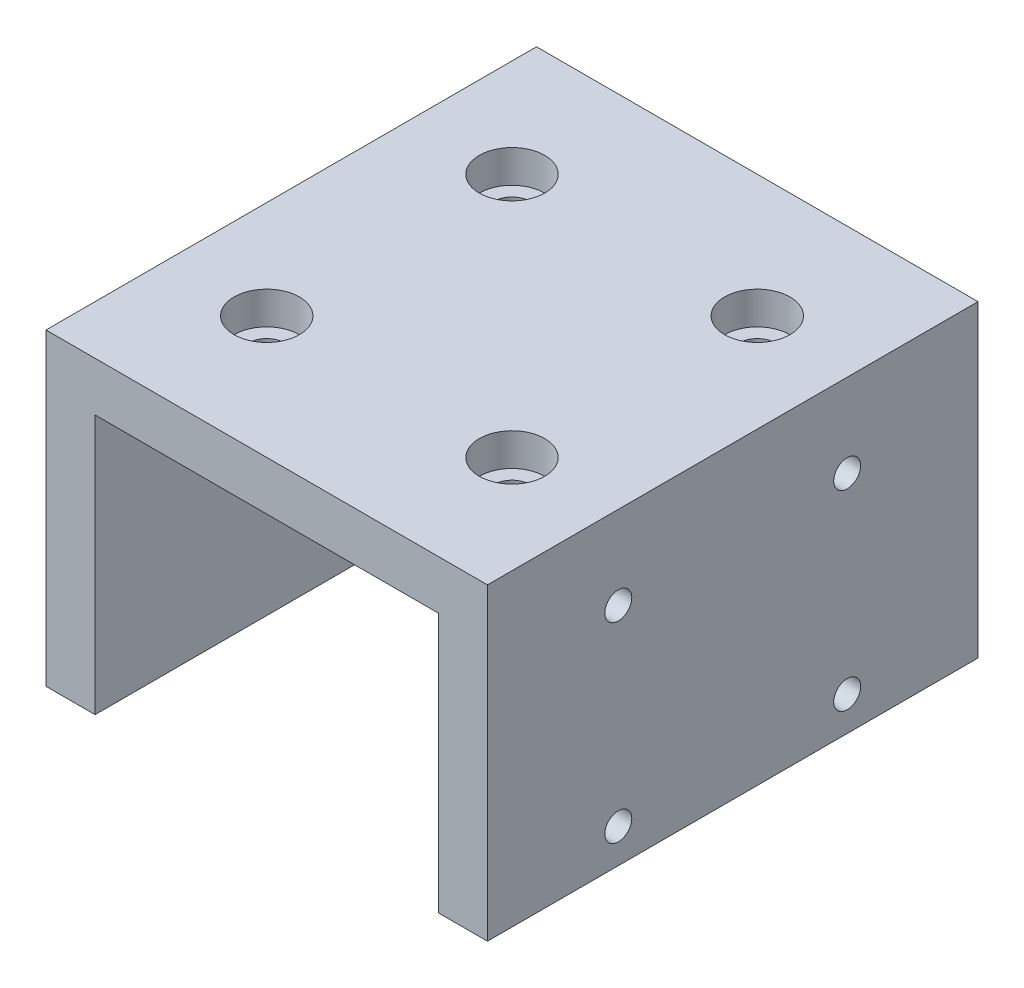
ISO-10303-21;
HEADER;
FILE_DESCRIPTION(('STEP AP214'),'2;1');
FILE_NAME('part.step','',(''),(''),'','','');
FILE_SCHEMA(('AUTOMOTIVE_DESIGN { 1 0 10303 214 1 1 1 1 }'));
ENDSEC;
DATA;
#1=APPLICATION_CONTEXT('core data for automotive mechanical design processes');
#2=APPLICATION_PROTOCOL_DEFINITION('international standard','automotive_design',2000,#1);
#3=PRODUCT_CONTEXT('',#1,'mechanical');
#4=PRODUCT('Part','Part','',(#3));
#5=PRODUCT_RELATED_PRODUCT_CATEGORY('part','',(#4));
#6=PRODUCT_DEFINITION_FORMATION('','',#4);
#7=PRODUCT_DEFINITION_CONTEXT('part definition',#1,'design');
#8=PRODUCT_DEFINITION('design','',#6,#7);
#9=PRODUCT_DEFINITION_SHAPE('','',#8);
#10=(LENGTH_UNIT() NAMED_UNIT(*) SI_UNIT(.MILLI.,.METRE.));
#11=(NAMED_UNIT(*) PLANE_ANGLE_UNIT() SI_UNIT($,.RADIAN.));
#12=(NAMED_UNIT(*) SI_UNIT($,.STERADIAN.) SOLID_ANGLE_UNIT());
#13=UNCERTAINTY_MEASURE_WITH_UNIT(LENGTH_MEASURE(1.E-05),#10,'distance_accuracy_value','');
#14=(GEOMETRIC_REPRESENTATION_CONTEXT(3) GLOBAL_UNCERTAINTY_ASSIGNED_CONTEXT((#13)) GLOBAL_UNIT_ASSIGNED_CONTEXT((#10,
#11,#12)) REPRESENTATION_CONTEXT('',''));
#15=CARTESIAN_POINT('',(0.,0.,0.));
#16=DIRECTION('',(0.,0.,1.));
#17=DIRECTION('',(1.,0.,0.));
#18=AXIS2_PLACEMENT_3D('',#15,#16,#17);
#19=CARTESIAN_POINT('',(27.,37.75,30.));
#20=DIRECTION('',(-1.,0.,0.));
#21=DIRECTION('',(0.,-1.,0.));
#22=AXIS2_PLACEMENT_3D('',#19,#20,#21);
#23=PLANE('',#22);
#24=CARTESIAN_POINT('',(27.,27.575,14.));
#25=DIRECTION('',(1.,0.,0.));
#26=DIRECTION('',(0.,0.,-1.));
#27=AXIS2_PLACEMENT_3D('',#24,#25,#26);
#28=CIRCLE('',#27,1.65);
#29=CARTESIAN_POINT('',(27.,27.575,12.35));
#30=VERTEX_POINT('',#29);
#31=EDGE_CURVE('E302',#30,#30,#28,.T.);
#32=ORIENTED_EDGE('',*,*,#31,.F.);
#33=EDGE_LOOP('',(#32));
#34=FACE_BOUND('',#33,.T.);
#35=DIRECTION('',(0.,1.,0.));
#36=VECTOR('',#35,1.);
#37=CARTESIAN_POINT('',(27.,37.75,-30.));
#38=LINE('',#37,#36);
#39=CARTESIAN_POINT('',(27.,0.,-30.));
#40=VERTEX_POINT('',#39);
#41=CARTESIAN_POINT('',(27.,37.75,-30.));
#42=VERTEX_POINT('',#41);
#43=EDGE_CURVE('E141',#40,#42,#38,.T.);
#44=ORIENTED_EDGE('',*,*,#43,.T.);
#45=DIRECTION('',(0.,0.,-1.));
#46=VECTOR('',#45,1.);
#47=CARTESIAN_POINT('',(27.,37.75,30.));
#48=LINE('',#47,#46);
#49=CARTESIAN_POINT('',(27.,37.75,30.));
#50=VERTEX_POINT('',#49);
#51=EDGE_CURVE('E153',#50,#42,#48,.T.);
#52=ORIENTED_EDGE('',*,*,#51,.F.);
#53=DIRECTION('',(0.,1.,0.));
#54=VECTOR('',#53,1.);
#55=CARTESIAN_POINT('',(27.,37.75,30.));
#56=LINE('',#55,#54);
#57=CARTESIAN_POINT('',(27.,0.,30.));
#58=VERTEX_POINT('',#57);
#59=EDGE_CURVE('E161',#58,#50,#56,.T.);
#60=ORIENTED_EDGE('',*,*,#59,.F.);
#61=DIRECTION('',(0.,0.,-1.));
#62=VECTOR('',#61,1.);
#63=CARTESIAN_POINT('',(27.,0.,30.));
#64=LINE('',#63,#62);
#65=EDGE_CURVE('E55',#58,#40,#64,.T.);
#66=ORIENTED_EDGE('',*,*,#65,.T.);
#67=EDGE_LOOP('',(#44,#52,#60,#66));
#68=FACE_BOUND('',#67,.T.);
#69=CARTESIAN_POINT('',(27.,4.175,-14.));
#70=DIRECTION('',(1.,0.,0.));
#71=DIRECTION('',(0.,0.,-1.));
#72=AXIS2_PLACEMENT_3D('',#69,#70,#71);
#73=CIRCLE('',#72,1.65);
#74=CARTESIAN_POINT('',(27.,4.175,-15.65));
#75=VERTEX_POINT('',#74);
#76=EDGE_CURVE('E308',#75,#75,#73,.T.);
#77=ORIENTED_EDGE('',*,*,#76,.F.);
#78=EDGE_LOOP('',(#77));
#79=FACE_BOUND('',#78,.T.);
#80=CARTESIAN_POINT('',(27.,27.575,-14.));
#81=DIRECTION('',(1.,0.,0.));
#82=DIRECTION('',(0.,0.,-1.));
#83=AXIS2_PLACEMENT_3D('',#80,#81,#82);
#84=CIRCLE('',#83,1.65);
#85=CARTESIAN_POINT('',(27.,27.575,-15.65));
#86=VERTEX_POINT('',#85);
#87=EDGE_CURVE('E314',#86,#86,#84,.T.);
#88=ORIENTED_EDGE('',*,*,#87,.F.);
#89=EDGE_LOOP('',(#88));
#90=FACE_BOUND('',#89,.T.);
#91=CARTESIAN_POINT('',(27.,4.175,14.));
#92=DIRECTION('',(1.,0.,0.));
#93=DIRECTION('',(0.,0.,-1.));
#94=AXIS2_PLACEMENT_3D('',#91,#92,#93);
#95=CIRCLE('',#94,1.65);
#96=CARTESIAN_POINT('',(27.,4.175,12.35));
#97=VERTEX_POINT('',#96);
#98=EDGE_CURVE('E320',#97,#97,#95,.T.);
#99=ORIENTED_EDGE('',*,*,#98,.F.);
#100=EDGE_LOOP('',(#99));
#101=FACE_BOUND('',#100,.T.);
#102=ADVANCED_FACE('F47',(#34,#68,#79,#90,#101),#23,.F.);
#103=CARTESIAN_POINT('',(-27.,37.75,30.));
#104=DIRECTION('',(0.,-1.,0.));
#105=DIRECTION('',(0.,0.,-1.));
#106=AXIS2_PLACEMENT_3D('',#103,#104,#105);
#107=PLANE('',#106);
#108=DIRECTION('',(-1.,0.,0.));
#109=VECTOR('',#108,1.);
#110=CARTESIAN_POINT('',(-27.,37.75,-30.));
#111=LINE('',#110,#109);
#112=CARTESIAN_POINT('',(-27.,37.75,-30.));
#113=VERTEX_POINT('',#112);
#114=EDGE_CURVE('E92',#42,#113,#111,.T.);
#115=ORIENTED_EDGE('',*,*,#114,.T.);
#116=DIRECTION('',(0.,0.,-1.));
#117=VECTOR('',#116,1.);
#118=CARTESIAN_POINT('',(-27.,37.75,30.));
#119=LINE('',#118,#117);
#120=CARTESIAN_POINT('',(-27.,37.75,30.));
#121=VERTEX_POINT('',#120);
#122=EDGE_CURVE('E151',#121,#113,#119,.T.);
#123=ORIENTED_EDGE('',*,*,#122,.F.);
#124=DIRECTION('',(-1.,0.,0.));
#125=VECTOR('',#124,1.);
#126=CARTESIAN_POINT('',(-27.,37.75,30.));
#127=LINE('',#126,#125);
#128=EDGE_CURVE('E71',#50,#121,#127,.T.);
#129=ORIENTED_EDGE('',*,*,#128,.F.);
#130=ORIENTED_EDGE('',*,*,#51,.T.);
#131=EDGE_LOOP('',(#115,#123,#129,#130));
#132=FACE_BOUND('',#131,.T.);
#133=CARTESIAN_POINT('',(15.,37.75,-15.));
#134=DIRECTION('',(0.,1.,0.));
#135=DIRECTION('',(0.,0.,1.));
#136=AXIS2_PLACEMENT_3D('',#133,#134,#135);
#137=CIRCLE('',#136,4.);
#138=CARTESIAN_POINT('',(15.,37.75,-11.));
#139=VERTEX_POINT('',#138);
#140=EDGE_CURVE('E260',#139,#139,#137,.T.);
#141=ORIENTED_EDGE('',*,*,#140,.F.);
#142=EDGE_LOOP('',(#141));
#143=FACE_BOUND('',#142,.T.);
#144=CARTESIAN_POINT('',(-15.,37.75,15.));
#145=DIRECTION('',(0.,1.,0.));
#146=DIRECTION('',(0.,0.,1.));
#147=AXIS2_PLACEMENT_3D('',#144,#145,#146);
#148=CIRCLE('',#147,4.);
#149=CARTESIAN_POINT('',(-15.,37.75,19.));
#150=VERTEX_POINT('',#149);
#151=EDGE_CURVE('E272',#150,#150,#148,.T.);
#152=ORIENTED_EDGE('',*,*,#151,.F.);
#153=EDGE_LOOP('',(#152));
#154=FACE_BOUND('',#153,.T.);
#155=CARTESIAN_POINT('',(-15.,37.75,-15.));
#156=DIRECTION('',(0.,1.,0.));
#157=DIRECTION('',(0.,0.,1.));
#158=AXIS2_PLACEMENT_3D('',#155,#156,#157);
#159=CIRCLE('',#158,4.);
#160=CARTESIAN_POINT('',(-15.,37.75,-11.));
#161=VERTEX_POINT('',#160);
#162=EDGE_CURVE('E284',#161,#161,#159,.T.);
#163=ORIENTED_EDGE('',*,*,#162,.F.);
#164=EDGE_LOOP('',(#163));
#165=FACE_BOUND('',#164,.T.);
#166=CARTESIAN_POINT('',(15.,37.75,15.));
#167=DIRECTION('',(0.,1.,0.));
#168=DIRECTION('',(0.,0.,1.));
#169=AXIS2_PLACEMENT_3D('',#166,#167,#168);
#170=CIRCLE('',#169,4.);
#171=CARTESIAN_POINT('',(15.,37.75,19.));
#172=VERTEX_POINT('',#171);
#173=EDGE_CURVE('E296',#172,#172,#170,.T.);
#174=ORIENTED_EDGE('',*,*,#173,.F.);
#175=EDGE_LOOP('',(#174));
#176=FACE_BOUND('',#175,.T.);
#177=ADVANCED_FACE('F180',(#132,#143,#154,#165,#176),#107,.F.);
#178=CARTESIAN_POINT('',(-27.,37.75,30.));
#179=DIRECTION('',(1.,0.,0.));
#180=DIRECTION('',(0.,1.,0.));
#181=AXIS2_PLACEMENT_3D('',#178,#179,#180);
#182=PLANE('',#181);
#183=CARTESIAN_POINT('',(-27.,25.4,15.));
#184=DIRECTION('',(-1.,0.,0.));
#185=DIRECTION('',(0.,0.,1.));
#186=AXIS2_PLACEMENT_3D('',#183,#184,#185);
#187=CIRCLE('',#186,4.);
#188=CARTESIAN_POINT('',(-27.,25.4,19.));
#189=VERTEX_POINT('',#188);
#190=EDGE_CURVE('E200',#189,#189,#187,.T.);
#191=ORIENTED_EDGE('',*,*,#190,.F.);
#192=EDGE_LOOP('',(#191));
#193=FACE_BOUND('',#192,.T.);
#194=DIRECTION('',(0.,-1.,0.));
#195=VECTOR('',#194,1.);
#196=CARTESIAN_POINT('',(-27.,37.75,-30.));
#197=LINE('',#196,#195);
#198=CARTESIAN_POINT('',(-27.,0.,-30.));
#199=VERTEX_POINT('',#198);
#200=EDGE_CURVE('E145',#113,#199,#197,.T.);
#201=ORIENTED_EDGE('',*,*,#200,.T.);
#202=DIRECTION('',(0.,0.,-1.));
#203=VECTOR('',#202,1.);
#204=CARTESIAN_POINT('',(-27.,0.,30.));
#205=LINE('',#204,#203);
#206=CARTESIAN_POINT('',(-27.,0.,30.));
#207=VERTEX_POINT('',#206);
#208=EDGE_CURVE('E11',#207,#199,#205,.T.);
#209=ORIENTED_EDGE('',*,*,#208,.F.);
#210=DIRECTION('',(0.,-1.,0.));
#211=VECTOR('',#210,1.);
#212=CARTESIAN_POINT('',(-27.,37.75,30.));
#213=LINE('',#212,#211);
#214=EDGE_CURVE('E150',#121,#207,#213,.T.);
#215=ORIENTED_EDGE('',*,*,#214,.F.);
#216=ORIENTED_EDGE('',*,*,#122,.T.);
#217=EDGE_LOOP('',(#201,#209,#215,#216));
#218=FACE_BOUND('',#217,.T.);
#219=CARTESIAN_POINT('',(-27.,25.4,-15.));
#220=DIRECTION('',(-1.,0.,0.));
#221=DIRECTION('',(0.,0.,1.));
#222=AXIS2_PLACEMENT_3D('',#219,#220,#221);
#223=CIRCLE('',#222,4.);
#224=CARTESIAN_POINT('',(-27.,25.4,-11.));
#225=VERTEX_POINT('',#224);
#226=EDGE_CURVE('E212',#225,#225,#223,.T.);
#227=ORIENTED_EDGE('',*,*,#226,.F.);
#228=EDGE_LOOP('',(#227));
#229=FACE_BOUND('',#228,.T.);
#230=CARTESIAN_POINT('',(-27.,7.75000000000002,0.));
#231=DIRECTION('',(-1.,0.,0.));
#232=DIRECTION('',(0.,0.,1.));
#233=AXIS2_PLACEMENT_3D('',#230,#231,#232);
#234=CIRCLE('',#233,4.);
#235=CARTESIAN_POINT('',(-27.,7.75000000000002,4.));
#236=VERTEX_POINT('',#235);
#237=EDGE_CURVE('E224',#236,#236,#234,.T.);
#238=ORIENTED_EDGE('',*,*,#237,.F.);
#239=EDGE_LOOP('',(#238));
#240=FACE_BOUND('',#239,.T.);
#241=CARTESIAN_POINT('',(-27.,24.25,0.));
#242=DIRECTION('',(-1.,0.,0.));
#243=DIRECTION('',(0.,0.,1.));
#244=AXIS2_PLACEMENT_3D('',#241,#242,#243);
#245=CIRCLE('',#244,4.);
#246=CARTESIAN_POINT('',(-27.,24.25,4.));
#247=VERTEX_POINT('',#246);
#248=EDGE_CURVE('E236',#247,#247,#245,.T.);
#249=ORIENTED_EDGE('',*,*,#248,.F.);
#250=EDGE_LOOP('',(#249));
#251=FACE_BOUND('',#250,.T.);
#252=CARTESIAN_POINT('',(-27.,23.25,-24.5));
#253=DIRECTION('',(-1.,0.,0.));
#254=DIRECTION('',(0.,0.,1.));
#255=AXIS2_PLACEMENT_3D('',#252,#253,#254);
#256=CIRCLE('',#255,2.74999999999999);
#257=CARTESIAN_POINT('',(-27.,23.25,-21.75));
#258=VERTEX_POINT('',#257);
#259=EDGE_CURVE('E242',#258,#258,#256,.T.);
#260=ORIENTED_EDGE('',*,*,#259,.F.);
#261=EDGE_LOOP('',(#260));
#262=FACE_BOUND('',#261,.T.);
#263=CARTESIAN_POINT('',(-27.,6.75000000000002,-24.5));
#264=DIRECTION('',(-1.,0.,0.));
#265=DIRECTION('',(0.,0.,1.));
#266=AXIS2_PLACEMENT_3D('',#263,#264,#265);
#267=CIRCLE('',#266,2.74999999999999);
#268=CARTESIAN_POINT('',(-27.,6.75000000000002,-21.75));
#269=VERTEX_POINT('',#268);
#270=EDGE_CURVE('E248',#269,#269,#267,.T.);
#271=ORIENTED_EDGE('',*,*,#270,.F.);
#272=EDGE_LOOP('',(#271));
#273=FACE_BOUND('',#272,.T.);
#274=ADVANCED_FACE('F49',(#193,#218,#229,#240,#251,#262,#273),#182,.F.);
#275=CARTESIAN_POINT('',(-27.,0.,30.));
#276=DIRECTION('',(0.,1.,0.));
#277=DIRECTION('',(0.,0.,1.));
#278=AXIS2_PLACEMENT_3D('',#275,#276,#277);
#279=PLANE('',#278);
#280=DIRECTION('',(1.,0.,0.));
#281=VECTOR('',#280,1.);
#282=CARTESIAN_POINT('',(-27.,0.,-30.));
#283=LINE('',#282,#281);
#284=CARTESIAN_POINT('',(-21.,0.,-30.));
#285=VERTEX_POINT('',#284);
#286=EDGE_CURVE('E133',#199,#285,#283,.T.);
#287=ORIENTED_EDGE('',*,*,#286,.T.);
#288=DIRECTION('',(0.,0.,1.));
#289=VECTOR('',#288,1.);
#290=CARTESIAN_POINT('',(-21.,0.,-30.));
#291=LINE('',#290,#289);
#292=CARTESIAN_POINT('',(-21.,0.,30.));
#293=VERTEX_POINT('',#292);
#294=EDGE_CURVE('E121',#285,#293,#291,.T.);
#295=ORIENTED_EDGE('',*,*,#294,.T.);
#296=DIRECTION('',(1.,0.,0.));
#297=VECTOR('',#296,1.);
#298=CARTESIAN_POINT('',(-27.,0.,30.));
#299=LINE('',#298,#297);
#300=EDGE_CURVE('E99',#207,#293,#299,.T.);
#301=ORIENTED_EDGE('',*,*,#300,.F.);
#302=ORIENTED_EDGE('',*,*,#208,.T.);
#303=EDGE_LOOP('',(#287,#295,#301,#302));
#304=FACE_BOUND('',#303,.T.);
#305=ADVANCED_FACE('F138',(#304),#279,.F.);
#306=CARTESIAN_POINT('',(21.,0.,30.));
#307=VERTEX_POINT('',#306);
#308=EDGE_CURVE('E176',#307,#58,#299,.T.);
#309=ORIENTED_EDGE('',*,*,#308,.F.);
#310=DIRECTION('',(0.,0.,1.));
#311=VECTOR('',#310,1.);
#312=CARTESIAN_POINT('',(21.,0.,-30.));
#313=LINE('',#312,#311);
#314=CARTESIAN_POINT('',(21.,0.,-30.));
#315=VERTEX_POINT('',#314);
#316=EDGE_CURVE('E128',#315,#307,#313,.T.);
#317=ORIENTED_EDGE('',*,*,#316,.F.);
#318=EDGE_CURVE('E142',#315,#40,#283,.T.);
#319=ORIENTED_EDGE('',*,*,#318,.T.);
#320=ORIENTED_EDGE('',*,*,#65,.F.);
#321=EDGE_LOOP('',(#309,#317,#319,#320));
#322=FACE_BOUND('',#321,.T.);
#323=ADVANCED_FACE('F336',(#322),#279,.F.);
#324=CARTESIAN_POINT('',(0.,0.,30.));
#325=DIRECTION('',(0.,0.,1.));
#326=DIRECTION('',(1.,0.,0.));
#327=AXIS2_PLACEMENT_3D('',#324,#325,#326);
#328=PLANE('',#327);
#329=DIRECTION('',(0.,-1.,0.));
#330=VECTOR('',#329,1.);
#331=CARTESIAN_POINT('',(-21.,31.75,30.));
#332=LINE('',#331,#330);
#333=CARTESIAN_POINT('',(-21.,31.75,30.));
#334=VERTEX_POINT('',#333);
#335=EDGE_CURVE('E126',#334,#293,#332,.T.);
#336=ORIENTED_EDGE('',*,*,#335,.F.);
#337=DIRECTION('',(-1.,0.,0.));
#338=VECTOR('',#337,1.);
#339=CARTESIAN_POINT('',(-21.,31.75,30.));
#340=LINE('',#339,#338);
#341=CARTESIAN_POINT('',(21.,31.75,30.));
#342=VERTEX_POINT('',#341);
#343=EDGE_CURVE('E136',#342,#334,#340,.T.);
#344=ORIENTED_EDGE('',*,*,#343,.F.);
#345=DIRECTION('',(0.,1.,0.));
#346=VECTOR('',#345,1.);
#347=CARTESIAN_POINT('',(21.,31.75,30.));
#348=LINE('',#347,#346);
#349=EDGE_CURVE('E185',#307,#342,#348,.T.);
#350=ORIENTED_EDGE('',*,*,#349,.F.);
#351=ORIENTED_EDGE('',*,*,#308,.T.);
#352=ORIENTED_EDGE('',*,*,#59,.T.);
#353=ORIENTED_EDGE('',*,*,#128,.T.);
#354=ORIENTED_EDGE('',*,*,#214,.T.);
#355=ORIENTED_EDGE('',*,*,#300,.T.);
#356=EDGE_LOOP('',(#336,#344,#350,#351,#352,#353,#354,#355));
#357=FACE_BOUND('',#356,.T.);
#358=ADVANCED_FACE('F178',(#357),#328,.T.);
#359=CARTESIAN_POINT('',(0.,0.,-30.));
#360=DIRECTION('',(0.,0.,1.));
#361=DIRECTION('',(1.,0.,0.));
#362=AXIS2_PLACEMENT_3D('',#359,#360,#361);
#363=PLANE('',#362);
#364=DIRECTION('',(-1.,0.,0.));
#365=VECTOR('',#364,1.);
#366=CARTESIAN_POINT('',(-21.,31.75,-30.));
#367=LINE('',#366,#365);
#368=CARTESIAN_POINT('',(21.,31.75,-30.));
#369=VERTEX_POINT('',#368);
#370=CARTESIAN_POINT('',(-21.,31.75,-30.));
#371=VERTEX_POINT('',#370);
#372=EDGE_CURVE('E62',#369,#371,#367,.T.);
#373=ORIENTED_EDGE('',*,*,#372,.T.);
#374=DIRECTION('',(0.,-1.,0.));
#375=VECTOR('',#374,1.);
#376=CARTESIAN_POINT('',(-21.,31.75,-30.));
#377=LINE('',#376,#375);
#378=EDGE_CURVE('E124',#371,#285,#377,.T.);
#379=ORIENTED_EDGE('',*,*,#378,.T.);
#380=ORIENTED_EDGE('',*,*,#286,.F.);
#381=ORIENTED_EDGE('',*,*,#200,.F.);
#382=ORIENTED_EDGE('',*,*,#114,.F.);
#383=ORIENTED_EDGE('',*,*,#43,.F.);
#384=ORIENTED_EDGE('',*,*,#318,.F.);
#385=DIRECTION('',(0.,1.,0.));
#386=VECTOR('',#385,1.);
#387=CARTESIAN_POINT('',(21.,31.75,-30.));
#388=LINE('',#387,#386);
#389=EDGE_CURVE('E135',#315,#369,#388,.T.);
#390=ORIENTED_EDGE('',*,*,#389,.T.);
#391=EDGE_LOOP('',(#373,#379,#380,#381,#382,#383,#384,#390));
#392=FACE_BOUND('',#391,.T.);
#393=ADVANCED_FACE('F131',(#392),#363,.F.);
#394=CARTESIAN_POINT('',(-21.,31.75,-30.));
#395=DIRECTION('',(-1.,0.,0.));
#396=DIRECTION('',(0.,-1.,0.));
#397=AXIS2_PLACEMENT_3D('',#394,#395,#396);
#398=PLANE('',#397);
#399=CARTESIAN_POINT('',(-21.,6.75000000000002,-24.5));
#400=DIRECTION('',(-1.,0.,0.));
#401=DIRECTION('',(0.,-1.,0.));
#402=AXIS2_PLACEMENT_3D('',#399,#400,#401);
#403=CIRCLE('',#402,2.75);
#404=CARTESIAN_POINT('',(-21.,4.00000000000002,-24.5));
#405=VERTEX_POINT('',#404);
#406=EDGE_CURVE('E245',#405,#405,#403,.T.);
#407=ORIENTED_EDGE('',*,*,#406,.T.);
#408=EDGE_LOOP('',(#407));
#409=FACE_BOUND('',#408,.T.);
#410=CARTESIAN_POINT('',(-21.,23.25,-24.5));
#411=DIRECTION('',(-1.,0.,0.));
#412=DIRECTION('',(0.,-1.,0.));
#413=AXIS2_PLACEMENT_3D('',#410,#411,#412);
#414=CIRCLE('',#413,2.75);
#415=CARTESIAN_POINT('',(-21.,20.5,-24.5));
#416=VERTEX_POINT('',#415);
#417=EDGE_CURVE('E239',#416,#416,#414,.T.);
#418=ORIENTED_EDGE('',*,*,#417,.T.);
#419=EDGE_LOOP('',(#418));
#420=FACE_BOUND('',#419,.T.);
#421=CARTESIAN_POINT('',(-21.,24.25,0.));
#422=DIRECTION('',(-1.,0.,0.));
#423=DIRECTION('',(0.,-1.,0.));
#424=AXIS2_PLACEMENT_3D('',#421,#422,#423);
#425=CIRCLE('',#424,2.25);
#426=CARTESIAN_POINT('',(-21.,22.,0.));
#427=VERTEX_POINT('',#426);
#428=EDGE_CURVE('E227',#427,#427,#425,.T.);
#429=ORIENTED_EDGE('',*,*,#428,.T.);
#430=EDGE_LOOP('',(#429));
#431=FACE_BOUND('',#430,.T.);
#432=CARTESIAN_POINT('',(-21.,7.75000000000002,0.));
#433=DIRECTION('',(-1.,0.,0.));
#434=DIRECTION('',(0.,-1.,0.));
#435=AXIS2_PLACEMENT_3D('',#432,#433,#434);
#436=CIRCLE('',#435,2.25);
#437=CARTESIAN_POINT('',(-21.,5.50000000000002,0.));
#438=VERTEX_POINT('',#437);
#439=EDGE_CURVE('E215',#438,#438,#436,.T.);
#440=ORIENTED_EDGE('',*,*,#439,.T.);
#441=EDGE_LOOP('',(#440));
#442=FACE_BOUND('',#441,.T.);
#443=CARTESIAN_POINT('',(-21.,25.4,-15.));
#444=DIRECTION('',(-1.,0.,0.));
#445=DIRECTION('',(0.,-1.,0.));
#446=AXIS2_PLACEMENT_3D('',#443,#444,#445);
#447=CIRCLE('',#446,2.25);
#448=CARTESIAN_POINT('',(-21.,23.15,-15.));
#449=VERTEX_POINT('',#448);
#450=EDGE_CURVE('E203',#449,#449,#447,.T.);
#451=ORIENTED_EDGE('',*,*,#450,.T.);
#452=EDGE_LOOP('',(#451));
#453=FACE_BOUND('',#452,.T.);
#454=CARTESIAN_POINT('',(-21.,25.4,15.));
#455=DIRECTION('',(-1.,0.,0.));
#456=DIRECTION('',(0.,-1.,0.));
#457=AXIS2_PLACEMENT_3D('',#454,#455,#456);
#458=CIRCLE('',#457,2.25);
#459=CARTESIAN_POINT('',(-21.,23.15,15.));
#460=VERTEX_POINT('',#459);
#461=EDGE_CURVE('E186',#460,#460,#458,.T.);
#462=ORIENTED_EDGE('',*,*,#461,.T.);
#463=EDGE_LOOP('',(#462));
#464=FACE_BOUND('',#463,.T.);
#465=ORIENTED_EDGE('',*,*,#335,.T.);
#466=ORIENTED_EDGE('',*,*,#294,.F.);
#467=ORIENTED_EDGE('',*,*,#378,.F.);
#468=DIRECTION('',(0.,0.,1.));
#469=VECTOR('',#468,1.);
#470=CARTESIAN_POINT('',(-21.,31.75,-30.));
#471=LINE('',#470,#469);
#472=EDGE_CURVE('E166',#371,#334,#471,.T.);
#473=ORIENTED_EDGE('',*,*,#472,.T.);
#474=EDGE_LOOP('',(#465,#466,#467,#473));
#475=FACE_BOUND('',#474,.T.);
#476=ADVANCED_FACE('F123',(#409,#420,#431,#442,#453,#464,#475),#398,.F.);
#477=CARTESIAN_POINT('',(-21.,31.75,-30.));
#478=DIRECTION('',(0.,1.,0.));
#479=DIRECTION('',(-1.,0.,0.));
#480=AXIS2_PLACEMENT_3D('',#477,#478,#479);
#481=PLANE('',#480);
#482=CARTESIAN_POINT('',(15.,31.75,15.));
#483=DIRECTION('',(0.,1.,0.));
#484=DIRECTION('',(-1.,0.,0.));
#485=AXIS2_PLACEMENT_3D('',#482,#483,#484);
#486=CIRCLE('',#485,2.25);
#487=CARTESIAN_POINT('',(12.75,31.75,15.));
#488=VERTEX_POINT('',#487);
#489=EDGE_CURVE('E287',#488,#488,#486,.T.);
#490=ORIENTED_EDGE('',*,*,#489,.T.);
#491=EDGE_LOOP('',(#490));
#492=FACE_BOUND('',#491,.T.);
#493=CARTESIAN_POINT('',(-15.,31.75,-15.));
#494=DIRECTION('',(0.,1.,0.));
#495=DIRECTION('',(-1.,0.,0.));
#496=AXIS2_PLACEMENT_3D('',#493,#494,#495);
#497=CIRCLE('',#496,2.25);
#498=CARTESIAN_POINT('',(-17.25,31.75,-15.));
#499=VERTEX_POINT('',#498);
#500=EDGE_CURVE('E275',#499,#499,#497,.T.);
#501=ORIENTED_EDGE('',*,*,#500,.T.);
#502=EDGE_LOOP('',(#501));
#503=FACE_BOUND('',#502,.T.);
#504=CARTESIAN_POINT('',(-15.,31.75,15.));
#505=DIRECTION('',(0.,1.,0.));
#506=DIRECTION('',(-1.,0.,0.));
#507=AXIS2_PLACEMENT_3D('',#504,#505,#506);
#508=CIRCLE('',#507,2.25);
#509=CARTESIAN_POINT('',(-17.25,31.75,15.));
#510=VERTEX_POINT('',#509);
#511=EDGE_CURVE('E263',#510,#510,#508,.T.);
#512=ORIENTED_EDGE('',*,*,#511,.T.);
#513=EDGE_LOOP('',(#512));
#514=FACE_BOUND('',#513,.T.);
#515=CARTESIAN_POINT('',(15.,31.75,-15.));
#516=DIRECTION('',(0.,1.,0.));
#517=DIRECTION('',(-1.,0.,0.));
#518=AXIS2_PLACEMENT_3D('',#515,#516,#517);
#519=CIRCLE('',#518,2.25);
#520=CARTESIAN_POINT('',(12.75,31.75,-15.));
#521=VERTEX_POINT('',#520);
#522=EDGE_CURVE('E251',#521,#521,#519,.T.);
#523=ORIENTED_EDGE('',*,*,#522,.T.);
#524=EDGE_LOOP('',(#523));
#525=FACE_BOUND('',#524,.T.);
#526=ORIENTED_EDGE('',*,*,#343,.T.);
#527=ORIENTED_EDGE('',*,*,#472,.F.);
#528=ORIENTED_EDGE('',*,*,#372,.F.);
#529=DIRECTION('',(0.,0.,1.));
#530=VECTOR('',#529,1.);
#531=CARTESIAN_POINT('',(21.,31.75,-30.));
#532=LINE('',#531,#530);
#533=EDGE_CURVE('E167',#369,#342,#532,.T.);
#534=ORIENTED_EDGE('',*,*,#533,.T.);
#535=EDGE_LOOP('',(#526,#527,#528,#534));
#536=FACE_BOUND('',#535,.T.);
#537=ADVANCED_FACE('F346',(#492,#503,#514,#525,#536),#481,.F.);
#538=CARTESIAN_POINT('',(21.,31.75,-30.));
#539=DIRECTION('',(1.,0.,0.));
#540=DIRECTION('',(0.,1.,0.));
#541=AXIS2_PLACEMENT_3D('',#538,#539,#540);
#542=PLANE('',#541);
#543=CARTESIAN_POINT('',(21.,4.175,14.));
#544=DIRECTION('',(1.,0.,0.));
#545=DIRECTION('',(0.,1.,0.));
#546=AXIS2_PLACEMENT_3D('',#543,#544,#545);
#547=CIRCLE('',#546,1.65);
#548=CARTESIAN_POINT('',(21.,5.825,14.));
#549=VERTEX_POINT('',#548);
#550=EDGE_CURVE('E317',#549,#549,#547,.T.);
#551=ORIENTED_EDGE('',*,*,#550,.T.);
#552=EDGE_LOOP('',(#551));
#553=FACE_BOUND('',#552,.T.);
#554=CARTESIAN_POINT('',(21.,27.575,-14.));
#555=DIRECTION('',(1.,0.,0.));
#556=DIRECTION('',(0.,1.,0.));
#557=AXIS2_PLACEMENT_3D('',#554,#555,#556);
#558=CIRCLE('',#557,1.65);
#559=CARTESIAN_POINT('',(21.,29.225,-14.));
#560=VERTEX_POINT('',#559);
#561=EDGE_CURVE('E311',#560,#560,#558,.T.);
#562=ORIENTED_EDGE('',*,*,#561,.T.);
#563=EDGE_LOOP('',(#562));
#564=FACE_BOUND('',#563,.T.);
#565=CARTESIAN_POINT('',(21.,4.175,-14.));
#566=DIRECTION('',(1.,0.,0.));
#567=DIRECTION('',(0.,1.,0.));
#568=AXIS2_PLACEMENT_3D('',#565,#566,#567);
#569=CIRCLE('',#568,1.65);
#570=CARTESIAN_POINT('',(21.,5.825,-14.));
#571=VERTEX_POINT('',#570);
#572=EDGE_CURVE('E305',#571,#571,#569,.T.);
#573=ORIENTED_EDGE('',*,*,#572,.T.);
#574=EDGE_LOOP('',(#573));
#575=FACE_BOUND('',#574,.T.);
#576=CARTESIAN_POINT('',(21.,27.575,14.));
#577=DIRECTION('',(1.,0.,0.));
#578=DIRECTION('',(0.,1.,0.));
#579=AXIS2_PLACEMENT_3D('',#576,#577,#578);
#580=CIRCLE('',#579,1.65);
#581=CARTESIAN_POINT('',(21.,29.225,14.));
#582=VERTEX_POINT('',#581);
#583=EDGE_CURVE('E299',#582,#582,#580,.T.);
#584=ORIENTED_EDGE('',*,*,#583,.T.);
#585=EDGE_LOOP('',(#584));
#586=FACE_BOUND('',#585,.T.);
#587=ORIENTED_EDGE('',*,*,#349,.T.);
#588=ORIENTED_EDGE('',*,*,#533,.F.);
#589=ORIENTED_EDGE('',*,*,#389,.F.);
#590=ORIENTED_EDGE('',*,*,#316,.T.);
#591=EDGE_LOOP('',(#587,#588,#589,#590));
#592=FACE_BOUND('',#591,.T.);
#593=ADVANCED_FACE('F345',(#553,#564,#575,#586,#592),#542,.F.);
#594=CARTESIAN_POINT('',(-27.,25.4,15.));
#595=DIRECTION('',(-1.,0.,0.));
#596=DIRECTION('',(0.,0.,1.));
#597=AXIS2_PLACEMENT_3D('',#594,#595,#596);
#598=CYLINDRICAL_SURFACE('',#597,2.25);
#599=ORIENTED_EDGE('',*,*,#461,.F.);
#600=EDGE_LOOP('',(#599));
#601=FACE_BOUND('',#600,.T.);
#602=CARTESIAN_POINT('',(-23.,25.4,15.));
#603=DIRECTION('',(-1.,0.,0.));
#604=DIRECTION('',(0.,0.,1.));
#605=AXIS2_PLACEMENT_3D('',#602,#603,#604);
#606=CIRCLE('',#605,2.25);
#607=CARTESIAN_POINT('',(-23.,25.4,17.25));
#608=VERTEX_POINT('',#607);
#609=EDGE_CURVE('E190',#608,#608,#606,.T.);
#610=ORIENTED_EDGE('',*,*,#609,.T.);
#611=EDGE_LOOP('',(#610));
#612=FACE_BOUND('',#611,.T.);
#613=ADVANCED_FACE('F354',(#601,#612),#598,.F.);
#614=CARTESIAN_POINT('',(-23.,27.65,15.));
#615=DIRECTION('',(1.,0.,0.));
#616=DIRECTION('',(0.,0.,-1.));
#617=AXIS2_PLACEMENT_3D('',#614,#615,#616);
#618=PLANE('',#617);
#619=ORIENTED_EDGE('',*,*,#609,.F.);
#620=EDGE_LOOP('',(#619));
#621=FACE_BOUND('',#620,.T.);
#622=CARTESIAN_POINT('',(-23.,25.4,15.));
#623=DIRECTION('',(-1.,0.,0.));
#624=DIRECTION('',(0.,0.,1.));
#625=AXIS2_PLACEMENT_3D('',#622,#623,#624);
#626=CIRCLE('',#625,4.);
#627=CARTESIAN_POINT('',(-23.,25.4,19.));
#628=VERTEX_POINT('',#627);
#629=EDGE_CURVE('E197',#628,#628,#626,.T.);
#630=ORIENTED_EDGE('',*,*,#629,.T.);
#631=EDGE_LOOP('',(#630));
#632=FACE_BOUND('',#631,.T.);
#633=ADVANCED_FACE('F376',(#621,#632),#618,.F.);
#634=CARTESIAN_POINT('',(-27.,25.4,15.));
#635=DIRECTION('',(-1.,0.,0.));
#636=DIRECTION('',(0.,0.,1.));
#637=AXIS2_PLACEMENT_3D('',#634,#635,#636);
#638=CYLINDRICAL_SURFACE('',#637,4.);
#639=ORIENTED_EDGE('',*,*,#629,.F.);
#640=EDGE_LOOP('',(#639));
#641=FACE_BOUND('',#640,.T.);
#642=ORIENTED_EDGE('',*,*,#190,.T.);
#643=EDGE_LOOP('',(#642));
#644=FACE_BOUND('',#643,.T.);
#645=ADVANCED_FACE('F385',(#641,#644),#638,.F.);
#646=CARTESIAN_POINT('',(-27.,25.4,-15.));
#647=DIRECTION('',(-1.,0.,0.));
#648=DIRECTION('',(0.,0.,1.));
#649=AXIS2_PLACEMENT_3D('',#646,#647,#648);
#650=CYLINDRICAL_SURFACE('',#649,2.25);
#651=ORIENTED_EDGE('',*,*,#450,.F.);
#652=EDGE_LOOP('',(#651));
#653=FACE_BOUND('',#652,.T.);
#654=CARTESIAN_POINT('',(-23.,25.4,-15.));
#655=DIRECTION('',(-1.,0.,0.));
#656=DIRECTION('',(0.,0.,1.));
#657=AXIS2_PLACEMENT_3D('',#654,#655,#656);
#658=CIRCLE('',#657,2.25);
#659=CARTESIAN_POINT('',(-23.,25.4,-12.75));
#660=VERTEX_POINT('',#659);
#661=EDGE_CURVE('E206',#660,#660,#658,.T.);
#662=ORIENTED_EDGE('',*,*,#661,.T.);
#663=EDGE_LOOP('',(#662));
#664=FACE_BOUND('',#663,.T.);
#665=ADVANCED_FACE('F393',(#653,#664),#650,.F.);
#666=CARTESIAN_POINT('',(-23.,27.65,-15.));
#667=DIRECTION('',(1.,0.,0.));
#668=DIRECTION('',(0.,0.,-1.));
#669=AXIS2_PLACEMENT_3D('',#666,#667,#668);
#670=PLANE('',#669);
#671=ORIENTED_EDGE('',*,*,#661,.F.);
#672=EDGE_LOOP('',(#671));
#673=FACE_BOUND('',#672,.T.);
#674=CARTESIAN_POINT('',(-23.,25.4,-15.));
#675=DIRECTION('',(-1.,0.,0.));
#676=DIRECTION('',(0.,0.,1.));
#677=AXIS2_PLACEMENT_3D('',#674,#675,#676);
#678=CIRCLE('',#677,4.);
#679=CARTESIAN_POINT('',(-23.,25.4,-11.));
#680=VERTEX_POINT('',#679);
#681=EDGE_CURVE('E209',#680,#680,#678,.T.);
#682=ORIENTED_EDGE('',*,*,#681,.T.);
#683=EDGE_LOOP('',(#682));
#684=FACE_BOUND('',#683,.T.);
#685=ADVANCED_FACE('F402',(#673,#684),#670,.F.);
#686=CARTESIAN_POINT('',(-27.,25.4,-15.));
#687=DIRECTION('',(-1.,0.,0.));
#688=DIRECTION('',(0.,0.,1.));
#689=AXIS2_PLACEMENT_3D('',#686,#687,#688);
#690=CYLINDRICAL_SURFACE('',#689,4.);
#691=ORIENTED_EDGE('',*,*,#681,.F.);
#692=EDGE_LOOP('',(#691));
#693=FACE_BOUND('',#692,.T.);
#694=ORIENTED_EDGE('',*,*,#226,.T.);
#695=EDGE_LOOP('',(#694));
#696=FACE_BOUND('',#695,.T.);
#697=ADVANCED_FACE('F411',(#693,#696),#690,.F.);
#698=CARTESIAN_POINT('',(-27.,7.75000000000002,0.));
#699=DIRECTION('',(-1.,0.,0.));
#700=DIRECTION('',(0.,0.,1.));
#701=AXIS2_PLACEMENT_3D('',#698,#699,#700);
#702=CYLINDRICAL_SURFACE('',#701,2.25);
#703=ORIENTED_EDGE('',*,*,#439,.F.);
#704=EDGE_LOOP('',(#703));
#705=FACE_BOUND('',#704,.T.);
#706=CARTESIAN_POINT('',(-23.,7.75000000000002,0.));
#707=DIRECTION('',(-1.,0.,0.));
#708=DIRECTION('',(0.,0.,1.));
#709=AXIS2_PLACEMENT_3D('',#706,#707,#708);
#710=CIRCLE('',#709,2.25);
#711=CARTESIAN_POINT('',(-23.,7.75000000000002,2.25));
#712=VERTEX_POINT('',#711);
#713=EDGE_CURVE('E218',#712,#712,#710,.T.);
#714=ORIENTED_EDGE('',*,*,#713,.T.);
#715=EDGE_LOOP('',(#714));
#716=FACE_BOUND('',#715,.T.);
#717=ADVANCED_FACE('F420',(#705,#716),#702,.F.);
#718=CARTESIAN_POINT('',(-23.,10.,0.));
#719=DIRECTION('',(1.,0.,0.));
#720=DIRECTION('',(0.,0.,-1.));
#721=AXIS2_PLACEMENT_3D('',#718,#719,#720);
#722=PLANE('',#721);
#723=ORIENTED_EDGE('',*,*,#713,.F.);
#724=EDGE_LOOP('',(#723));
#725=FACE_BOUND('',#724,.T.);
#726=CARTESIAN_POINT('',(-23.,7.75000000000002,0.));
#727=DIRECTION('',(-1.,0.,0.));
#728=DIRECTION('',(0.,0.,1.));
#729=AXIS2_PLACEMENT_3D('',#726,#727,#728);
#730=CIRCLE('',#729,4.);
#731=CARTESIAN_POINT('',(-23.,7.75000000000002,4.));
#732=VERTEX_POINT('',#731);
#733=EDGE_CURVE('E221',#732,#732,#730,.T.);
#734=ORIENTED_EDGE('',*,*,#733,.T.);
#735=EDGE_LOOP('',(#734));
#736=FACE_BOUND('',#735,.T.);
#737=ADVANCED_FACE('F429',(#725,#736),#722,.F.);
#738=CARTESIAN_POINT('',(-27.,7.75000000000002,0.));
#739=DIRECTION('',(-1.,0.,0.));
#740=DIRECTION('',(0.,0.,1.));
#741=AXIS2_PLACEMENT_3D('',#738,#739,#740);
#742=CYLINDRICAL_SURFACE('',#741,4.);
#743=ORIENTED_EDGE('',*,*,#733,.F.);
#744=EDGE_LOOP('',(#743));
#745=FACE_BOUND('',#744,.T.);
#746=ORIENTED_EDGE('',*,*,#237,.T.);
#747=EDGE_LOOP('',(#746));
#748=FACE_BOUND('',#747,.T.);
#749=ADVANCED_FACE('F438',(#745,#748),#742,.F.);
#750=CARTESIAN_POINT('',(-27.,24.25,0.));
#751=DIRECTION('',(-1.,0.,0.));
#752=DIRECTION('',(0.,0.,1.));
#753=AXIS2_PLACEMENT_3D('',#750,#751,#752);
#754=CYLINDRICAL_SURFACE('',#753,2.25);
#755=ORIENTED_EDGE('',*,*,#428,.F.);
#756=EDGE_LOOP('',(#755));
#757=FACE_BOUND('',#756,.T.);
#758=CARTESIAN_POINT('',(-23.,24.25,0.));
#759=DIRECTION('',(-1.,0.,0.));
#760=DIRECTION('',(0.,0.,1.));
#761=AXIS2_PLACEMENT_3D('',#758,#759,#760);
#762=CIRCLE('',#761,2.25);
#763=CARTESIAN_POINT('',(-23.,24.25,2.25));
#764=VERTEX_POINT('',#763);
#765=EDGE_CURVE('E230',#764,#764,#762,.T.);
#766=ORIENTED_EDGE('',*,*,#765,.T.);
#767=EDGE_LOOP('',(#766));
#768=FACE_BOUND('',#767,.T.);
#769=ADVANCED_FACE('F447',(#757,#768),#754,.F.);
#770=CARTESIAN_POINT('',(-23.,26.5,0.));
#771=DIRECTION('',(1.,0.,0.));
#772=DIRECTION('',(0.,0.,-1.));
#773=AXIS2_PLACEMENT_3D('',#770,#771,#772);
#774=PLANE('',#773);
#775=ORIENTED_EDGE('',*,*,#765,.F.);
#776=EDGE_LOOP('',(#775));
#777=FACE_BOUND('',#776,.T.);
#778=CARTESIAN_POINT('',(-23.,24.25,0.));
#779=DIRECTION('',(-1.,0.,0.));
#780=DIRECTION('',(0.,0.,1.));
#781=AXIS2_PLACEMENT_3D('',#778,#779,#780);
#782=CIRCLE('',#781,4.);
#783=CARTESIAN_POINT('',(-23.,24.25,4.));
#784=VERTEX_POINT('',#783);
#785=EDGE_CURVE('E233',#784,#784,#782,.T.);
#786=ORIENTED_EDGE('',*,*,#785,.T.);
#787=EDGE_LOOP('',(#786));
#788=FACE_BOUND('',#787,.T.);
#789=ADVANCED_FACE('F456',(#777,#788),#774,.F.);
#790=CARTESIAN_POINT('',(-27.,24.25,0.));
#791=DIRECTION('',(-1.,0.,0.));
#792=DIRECTION('',(0.,0.,1.));
#793=AXIS2_PLACEMENT_3D('',#790,#791,#792);
#794=CYLINDRICAL_SURFACE('',#793,4.);
#795=ORIENTED_EDGE('',*,*,#785,.F.);
#796=EDGE_LOOP('',(#795));
#797=FACE_BOUND('',#796,.T.);
#798=ORIENTED_EDGE('',*,*,#248,.T.);
#799=EDGE_LOOP('',(#798));
#800=FACE_BOUND('',#799,.T.);
#801=ADVANCED_FACE('F465',(#797,#800),#794,.F.);
#802=CARTESIAN_POINT('',(-27.,23.25,-24.5));
#803=DIRECTION('',(-1.,0.,0.));
#804=DIRECTION('',(0.,0.,1.));
#805=AXIS2_PLACEMENT_3D('',#802,#803,#804);
#806=CYLINDRICAL_SURFACE('',#805,2.75);
#807=ORIENTED_EDGE('',*,*,#417,.F.);
#808=EDGE_LOOP('',(#807));
#809=FACE_BOUND('',#808,.T.);
#810=ORIENTED_EDGE('',*,*,#259,.T.);
#811=EDGE_LOOP('',(#810));
#812=FACE_BOUND('',#811,.T.);
#813=ADVANCED_FACE('F474',(#809,#812),#806,.F.);
#814=CARTESIAN_POINT('',(-27.,6.75000000000002,-24.5));
#815=DIRECTION('',(-1.,0.,0.));
#816=DIRECTION('',(0.,0.,1.));
#817=AXIS2_PLACEMENT_3D('',#814,#815,#816);
#818=CYLINDRICAL_SURFACE('',#817,2.75);
#819=ORIENTED_EDGE('',*,*,#406,.F.);
#820=EDGE_LOOP('',(#819));
#821=FACE_BOUND('',#820,.T.);
#822=ORIENTED_EDGE('',*,*,#270,.T.);
#823=EDGE_LOOP('',(#822));
#824=FACE_BOUND('',#823,.T.);
#825=ADVANCED_FACE('F495',(#821,#824),#818,.F.);
#826=CARTESIAN_POINT('',(15.,37.75,-15.));
#827=DIRECTION('',(0.,1.,0.));
#828=DIRECTION('',(0.,0.,1.));
#829=AXIS2_PLACEMENT_3D('',#826,#827,#828);
#830=CYLINDRICAL_SURFACE('',#829,2.25);
#831=ORIENTED_EDGE('',*,*,#522,.F.);
#832=EDGE_LOOP('',(#831));
#833=FACE_BOUND('',#832,.T.);
#834=CARTESIAN_POINT('',(15.,33.75,-15.));
#835=DIRECTION('',(0.,1.,0.));
#836=DIRECTION('',(0.,0.,1.));
#837=AXIS2_PLACEMENT_3D('',#834,#835,#836);
#838=CIRCLE('',#837,2.25);
#839=CARTESIAN_POINT('',(15.,33.75,-12.75));
#840=VERTEX_POINT('',#839);
#841=EDGE_CURVE('E254',#840,#840,#838,.T.);
#842=ORIENTED_EDGE('',*,*,#841,.T.);
#843=EDGE_LOOP('',(#842));
#844=FACE_BOUND('',#843,.T.);
#845=ADVANCED_FACE('F502',(#833,#844),#830,.F.);
#846=CARTESIAN_POINT('',(17.25,33.75,-15.));
#847=DIRECTION('',(0.,-1.,0.));
#848=DIRECTION('',(0.,0.,-1.));
#849=AXIS2_PLACEMENT_3D('',#846,#847,#848);
#850=PLANE('',#849);
#851=ORIENTED_EDGE('',*,*,#841,.F.);
#852=EDGE_LOOP('',(#851));
#853=FACE_BOUND('',#852,.T.);
#854=CARTESIAN_POINT('',(15.,33.75,-15.));
#855=DIRECTION('',(0.,1.,0.));
#856=DIRECTION('',(0.,0.,1.));
#857=AXIS2_PLACEMENT_3D('',#854,#855,#856);
#858=CIRCLE('',#857,4.);
#859=CARTESIAN_POINT('',(15.,33.75,-11.));
#860=VERTEX_POINT('',#859);
#861=EDGE_CURVE('E257',#860,#860,#858,.T.);
#862=ORIENTED_EDGE('',*,*,#861,.T.);
#863=EDGE_LOOP('',(#862));
#864=FACE_BOUND('',#863,.T.);
#865=ADVANCED_FACE('F519',(#853,#864),#850,.F.);
#866=CARTESIAN_POINT('',(15.,37.75,-15.));
#867=DIRECTION('',(0.,1.,0.));
#868=DIRECTION('',(0.,0.,1.));
#869=AXIS2_PLACEMENT_3D('',#866,#867,#868);
#870=CYLINDRICAL_SURFACE('',#869,4.);
#871=ORIENTED_EDGE('',*,*,#861,.F.);
#872=EDGE_LOOP('',(#871));
#873=FACE_BOUND('',#872,.T.);
#874=ORIENTED_EDGE('',*,*,#140,.T.);
#875=EDGE_LOOP('',(#874));
#876=FACE_BOUND('',#875,.T.);
#877=ADVANCED_FACE('F529',(#873,#876),#870,.F.);
#878=CARTESIAN_POINT('',(-15.,37.75,15.));
#879=DIRECTION('',(0.,1.,0.));
#880=DIRECTION('',(0.,0.,1.));
#881=AXIS2_PLACEMENT_3D('',#878,#879,#880);
#882=CYLINDRICAL_SURFACE('',#881,2.25);
#883=ORIENTED_EDGE('',*,*,#511,.F.);
#884=EDGE_LOOP('',(#883));
#885=FACE_BOUND('',#884,.T.);
#886=CARTESIAN_POINT('',(-15.,33.75,15.));
#887=DIRECTION('',(0.,1.,0.));
#888=DIRECTION('',(0.,0.,1.));
#889=AXIS2_PLACEMENT_3D('',#886,#887,#888);
#890=CIRCLE('',#889,2.25);
#891=CARTESIAN_POINT('',(-15.,33.75,17.25));
#892=VERTEX_POINT('',#891);
#893=EDGE_CURVE('E266',#892,#892,#890,.T.);
#894=ORIENTED_EDGE('',*,*,#893,.T.);
#895=EDGE_LOOP('',(#894));
#896=FACE_BOUND('',#895,.T.);
#897=ADVANCED_FACE('F539',(#885,#896),#882,.F.);
#898=CARTESIAN_POINT('',(-12.75,33.75,15.));
#899=DIRECTION('',(0.,-1.,0.));
#900=DIRECTION('',(0.,0.,-1.));
#901=AXIS2_PLACEMENT_3D('',#898,#899,#900);
#902=PLANE('',#901);
#903=ORIENTED_EDGE('',*,*,#893,.F.);
#904=EDGE_LOOP('',(#903));
#905=FACE_BOUND('',#904,.T.);
#906=CARTESIAN_POINT('',(-15.,33.75,15.));
#907=DIRECTION('',(0.,1.,0.));
#908=DIRECTION('',(0.,0.,1.));
#909=AXIS2_PLACEMENT_3D('',#906,#907,#908);
#910=CIRCLE('',#909,4.);
#911=CARTESIAN_POINT('',(-15.,33.75,19.));
#912=VERTEX_POINT('',#911);
#913=EDGE_CURVE('E269',#912,#912,#910,.T.);
#914=ORIENTED_EDGE('',*,*,#913,.T.);
#915=EDGE_LOOP('',(#914));
#916=FACE_BOUND('',#915,.T.);
#917=ADVANCED_FACE('F549',(#905,#916),#902,.F.);
#918=CARTESIAN_POINT('',(-15.,37.75,15.));
#919=DIRECTION('',(0.,1.,0.));
#920=DIRECTION('',(0.,0.,1.));
#921=AXIS2_PLACEMENT_3D('',#918,#919,#920);
#922=CYLINDRICAL_SURFACE('',#921,4.);
#923=ORIENTED_EDGE('',*,*,#913,.F.);
#924=EDGE_LOOP('',(#923));
#925=FACE_BOUND('',#924,.T.);
#926=ORIENTED_EDGE('',*,*,#151,.T.);
#927=EDGE_LOOP('',(#926));
#928=FACE_BOUND('',#927,.T.);
#929=ADVANCED_FACE('F559',(#925,#928),#922,.F.);
#930=CARTESIAN_POINT('',(-15.,37.75,-15.));
#931=DIRECTION('',(0.,1.,0.));
#932=DIRECTION('',(0.,0.,1.));
#933=AXIS2_PLACEMENT_3D('',#930,#931,#932);
#934=CYLINDRICAL_SURFACE('',#933,2.25);
#935=ORIENTED_EDGE('',*,*,#500,.F.);
#936=EDGE_LOOP('',(#935));
#937=FACE_BOUND('',#936,.T.);
#938=CARTESIAN_POINT('',(-15.,33.75,-15.));
#939=DIRECTION('',(0.,1.,0.));
#940=DIRECTION('',(0.,0.,1.));
#941=AXIS2_PLACEMENT_3D('',#938,#939,#940);
#942=CIRCLE('',#941,2.25);
#943=CARTESIAN_POINT('',(-15.,33.75,-12.75));
#944=VERTEX_POINT('',#943);
#945=EDGE_CURVE('E278',#944,#944,#942,.T.);
#946=ORIENTED_EDGE('',*,*,#945,.T.);
#947=EDGE_LOOP('',(#946));
#948=FACE_BOUND('',#947,.T.);
#949=ADVANCED_FACE('F569',(#937,#948),#934,.F.);
#950=CARTESIAN_POINT('',(-12.75,33.75,-15.));
#951=DIRECTION('',(0.,-1.,0.));
#952=DIRECTION('',(0.,0.,-1.));
#953=AXIS2_PLACEMENT_3D('',#950,#951,#952);
#954=PLANE('',#953);
#955=ORIENTED_EDGE('',*,*,#945,.F.);
#956=EDGE_LOOP('',(#955));
#957=FACE_BOUND('',#956,.T.);
#958=CARTESIAN_POINT('',(-15.,33.75,-15.));
#959=DIRECTION('',(0.,1.,0.));
#960=DIRECTION('',(0.,0.,1.));
#961=AXIS2_PLACEMENT_3D('',#958,#959,#960);
#962=CIRCLE('',#961,4.);
#963=CARTESIAN_POINT('',(-15.,33.75,-11.));
#964=VERTEX_POINT('',#963);
#965=EDGE_CURVE('E281',#964,#964,#962,.T.);
#966=ORIENTED_EDGE('',*,*,#965,.T.);
#967=EDGE_LOOP('',(#966));
#968=FACE_BOUND('',#967,.T.);
#969=ADVANCED_FACE('F579',(#957,#968),#954,.F.);
#970=CARTESIAN_POINT('',(-15.,37.75,-15.));
#971=DIRECTION('',(0.,1.,0.));
#972=DIRECTION('',(0.,0.,1.));
#973=AXIS2_PLACEMENT_3D('',#970,#971,#972);
#974=CYLINDRICAL_SURFACE('',#973,4.);
#975=ORIENTED_EDGE('',*,*,#965,.F.);
#976=EDGE_LOOP('',(#975));
#977=FACE_BOUND('',#976,.T.);
#978=ORIENTED_EDGE('',*,*,#162,.T.);
#979=EDGE_LOOP('',(#978));
#980=FACE_BOUND('',#979,.T.);
#981=ADVANCED_FACE('F589',(#977,#980),#974,.F.);
#982=CARTESIAN_POINT('',(15.,37.75,15.));
#983=DIRECTION('',(0.,1.,0.));
#984=DIRECTION('',(0.,0.,1.));
#985=AXIS2_PLACEMENT_3D('',#982,#983,#984);
#986=CYLINDRICAL_SURFACE('',#985,2.25);
#987=ORIENTED_EDGE('',*,*,#489,.F.);
#988=EDGE_LOOP('',(#987));
#989=FACE_BOUND('',#988,.T.);
#990=CARTESIAN_POINT('',(15.,33.75,15.));
#991=DIRECTION('',(0.,1.,0.));
#992=DIRECTION('',(0.,0.,1.));
#993=AXIS2_PLACEMENT_3D('',#990,#991,#992);
#994=CIRCLE('',#993,2.25);
#995=CARTESIAN_POINT('',(15.,33.75,17.25));
#996=VERTEX_POINT('',#995);
#997=EDGE_CURVE('E290',#996,#996,#994,.T.);
#998=ORIENTED_EDGE('',*,*,#997,.T.);
#999=EDGE_LOOP('',(#998));
#1000=FACE_BOUND('',#999,.T.);
#1001=ADVANCED_FACE('F599',(#989,#1000),#986,.F.);
#1002=CARTESIAN_POINT('',(17.25,33.75,15.));
#1003=DIRECTION('',(0.,-1.,0.));
#1004=DIRECTION('',(0.,0.,-1.));
#1005=AXIS2_PLACEMENT_3D('',#1002,#1003,#1004);
#1006=PLANE('',#1005);
#1007=ORIENTED_EDGE('',*,*,#997,.F.);
#1008=EDGE_LOOP('',(#1007));
#1009=FACE_BOUND('',#1008,.T.);
#1010=CARTESIAN_POINT('',(15.,33.75,15.));
#1011=DIRECTION('',(0.,1.,0.));
#1012=DIRECTION('',(0.,0.,1.));
#1013=AXIS2_PLACEMENT_3D('',#1010,#1011,#1012);
#1014=CIRCLE('',#1013,4.);
#1015=CARTESIAN_POINT('',(15.,33.75,19.));
#1016=VERTEX_POINT('',#1015);
#1017=EDGE_CURVE('E293',#1016,#1016,#1014,.T.);
#1018=ORIENTED_EDGE('',*,*,#1017,.T.);
#1019=EDGE_LOOP('',(#1018));
#1020=FACE_BOUND('',#1019,.T.);
#1021=ADVANCED_FACE('F609',(#1009,#1020),#1006,.F.);
#1022=CARTESIAN_POINT('',(15.,37.75,15.));
#1023=DIRECTION('',(0.,1.,0.));
#1024=DIRECTION('',(0.,0.,1.));
#1025=AXIS2_PLACEMENT_3D('',#1022,#1023,#1024);
#1026=CYLINDRICAL_SURFACE('',#1025,4.);
#1027=ORIENTED_EDGE('',*,*,#1017,.F.);
#1028=EDGE_LOOP('',(#1027));
#1029=FACE_BOUND('',#1028,.T.);
#1030=ORIENTED_EDGE('',*,*,#173,.T.);
#1031=EDGE_LOOP('',(#1030));
#1032=FACE_BOUND('',#1031,.T.);
#1033=ADVANCED_FACE('F619',(#1029,#1032),#1026,.F.);
#1034=CARTESIAN_POINT('',(27.,27.575,14.));
#1035=DIRECTION('',(1.,0.,0.));
#1036=DIRECTION('',(0.,0.,-1.));
#1037=AXIS2_PLACEMENT_3D('',#1034,#1035,#1036);
#1038=CYLINDRICAL_SURFACE('',#1037,1.65);
#1039=ORIENTED_EDGE('',*,*,#583,.F.);
#1040=EDGE_LOOP('',(#1039));
#1041=FACE_BOUND('',#1040,.T.);
#1042=ORIENTED_EDGE('',*,*,#31,.T.);
#1043=EDGE_LOOP('',(#1042));
#1044=FACE_BOUND('',#1043,.T.);
#1045=ADVANCED_FACE('F629',(#1041,#1044),#1038,.F.);
#1046=CARTESIAN_POINT('',(27.,4.175,-14.));
#1047=DIRECTION('',(1.,0.,0.));
#1048=DIRECTION('',(0.,0.,-1.));
#1049=AXIS2_PLACEMENT_3D('',#1046,#1047,#1048);
#1050=CYLINDRICAL_SURFACE('',#1049,1.65);
#1051=ORIENTED_EDGE('',*,*,#572,.F.);
#1052=EDGE_LOOP('',(#1051));
#1053=FACE_BOUND('',#1052,.T.);
#1054=ORIENTED_EDGE('',*,*,#76,.T.);
#1055=EDGE_LOOP('',(#1054));
#1056=FACE_BOUND('',#1055,.T.);
#1057=ADVANCED_FACE('F646',(#1053,#1056),#1050,.F.);
#1058=CARTESIAN_POINT('',(27.,27.575,-14.));
#1059=DIRECTION('',(1.,0.,0.));
#1060=DIRECTION('',(0.,0.,-1.));
#1061=AXIS2_PLACEMENT_3D('',#1058,#1059,#1060);
#1062=CYLINDRICAL_SURFACE('',#1061,1.65);
#1063=ORIENTED_EDGE('',*,*,#561,.F.);
#1064=EDGE_LOOP('',(#1063));
#1065=FACE_BOUND('',#1064,.T.);
#1066=ORIENTED_EDGE('',*,*,#87,.T.);
#1067=EDGE_LOOP('',(#1066));
#1068=FACE_BOUND('',#1067,.T.);
#1069=ADVANCED_FACE('F658',(#1065,#1068),#1062,.F.);
#1070=CARTESIAN_POINT('',(27.,4.175,14.));
#1071=DIRECTION('',(1.,0.,0.));
#1072=DIRECTION('',(0.,0.,-1.));
#1073=AXIS2_PLACEMENT_3D('',#1070,#1071,#1072);
#1074=CYLINDRICAL_SURFACE('',#1073,1.65);
#1075=ORIENTED_EDGE('',*,*,#550,.F.);
#1076=EDGE_LOOP('',(#1075));
#1077=FACE_BOUND('',#1076,.T.);
#1078=ORIENTED_EDGE('',*,*,#98,.T.);
#1079=EDGE_LOOP('',(#1078));
#1080=FACE_BOUND('',#1079,.T.);
#1081=ADVANCED_FACE('F324',(#1077,#1080),#1074,.F.);
#1082=CLOSED_SHELL('',(#102,#177,#274,#305,#323,#358,#393,#476,#537,#593,#613,#633,#645,#665,
#685,#697,#717,#737,#749,#769,#789,#801,#813,#825,#845,#865,#877,#897,#917,#929,#949,#969,#981,
#1001,#1021,#1033,#1045,#1057,#1069,#1081));
#1083=MANIFOLD_SOLID_BREP('B2',#1082);
#1084=ADVANCED_BREP_SHAPE_REPRESENTATION('',(#18,#1083),#14);
#1085=SHAPE_DEFINITION_REPRESENTATION(#9,#1084);
ENDSEC;
END-ISO-10303-21;
